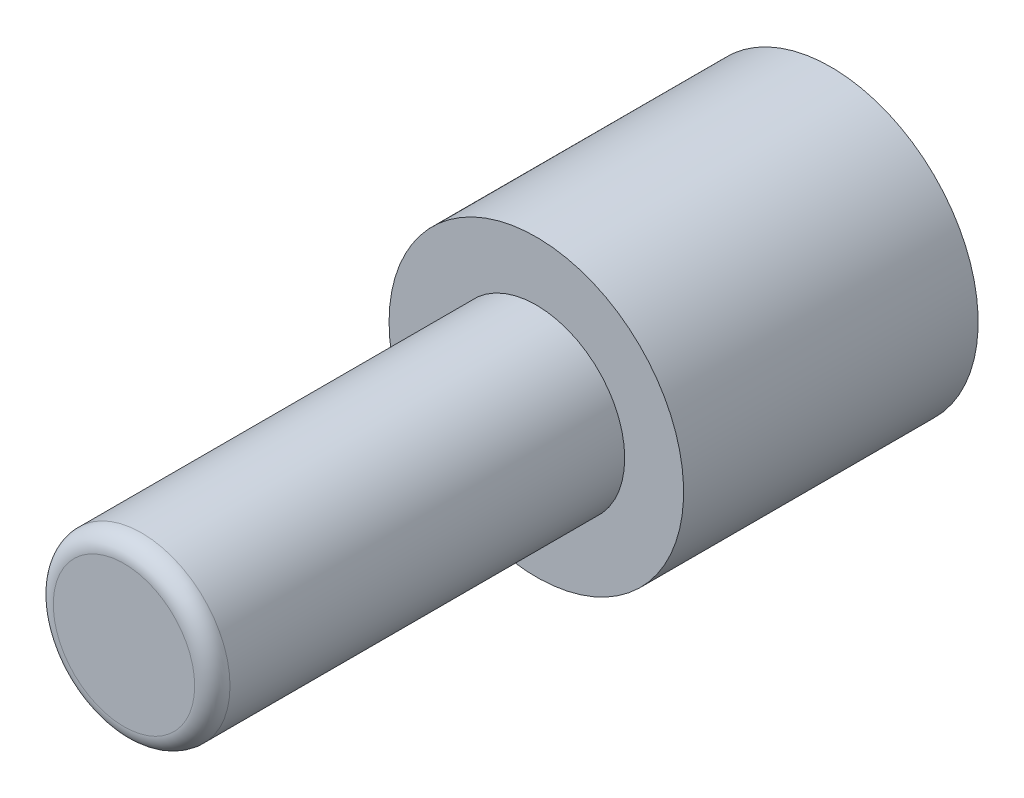
ISO-10303-21;
HEADER;
FILE_DESCRIPTION(('STEP AP214'),'2;1');
FILE_NAME('part.step','',(''),(''),'','','');
FILE_SCHEMA(('AUTOMOTIVE_DESIGN { 1 0 10303 214 1 1 1 1 }'));
ENDSEC;
DATA;
#1=APPLICATION_CONTEXT('core data for automotive mechanical design processes');
#2=APPLICATION_PROTOCOL_DEFINITION('international standard','automotive_design',2000,#1);
#3=PRODUCT_CONTEXT('',#1,'mechanical');
#4=PRODUCT('Part','Part','',(#3));
#5=PRODUCT_RELATED_PRODUCT_CATEGORY('part','',(#4));
#6=PRODUCT_DEFINITION_FORMATION('','',#4);
#7=PRODUCT_DEFINITION_CONTEXT('part definition',#1,'design');
#8=PRODUCT_DEFINITION('design','',#6,#7);
#9=PRODUCT_DEFINITION_SHAPE('','',#8);
#10=(LENGTH_UNIT() NAMED_UNIT(*) SI_UNIT(.MILLI.,.METRE.));
#11=(NAMED_UNIT(*) PLANE_ANGLE_UNIT() SI_UNIT($,.RADIAN.));
#12=(NAMED_UNIT(*) SI_UNIT($,.STERADIAN.) SOLID_ANGLE_UNIT());
#13=UNCERTAINTY_MEASURE_WITH_UNIT(LENGTH_MEASURE(1.E-05),#10,'distance_accuracy_value','');
#14=(GEOMETRIC_REPRESENTATION_CONTEXT(3) GLOBAL_UNCERTAINTY_ASSIGNED_CONTEXT((#13)) GLOBAL_UNIT_ASSIGNED_CONTEXT((#10,
#11,#12)) REPRESENTATION_CONTEXT('',''));
#15=CARTESIAN_POINT('',(0.,0.,0.));
#16=DIRECTION('',(0.,0.,1.));
#17=DIRECTION('',(1.,0.,0.));
#18=AXIS2_PLACEMENT_3D('',#15,#16,#17);
#19=CARTESIAN_POINT('',(0.,0.,7.));
#20=DIRECTION('',(0.,0.,-1.));
#21=DIRECTION('',(-1.,0.,0.));
#22=AXIS2_PLACEMENT_3D('',#19,#20,#21);
#23=CYLINDRICAL_SURFACE('',#22,1.5);
#24=CARTESIAN_POINT('',(0.,0.,6.7));
#25=DIRECTION('',(0.,0.,1.));
#26=DIRECTION('',(1.,0.,0.));
#27=AXIS2_PLACEMENT_3D('',#24,#25,#26);
#28=CIRCLE('',#27,1.5);
#29=CARTESIAN_POINT('',(1.5,0.,6.7));
#30=VERTEX_POINT('',#29);
#31=EDGE_CURVE('E10',#30,#30,#28,.F.);
#32=ORIENTED_EDGE('',*,*,#31,.T.);
#33=EDGE_LOOP('',(#32));
#34=FACE_BOUND('',#33,.T.);
#35=CARTESIAN_POINT('',(0.,0.,0.));
#36=DIRECTION('',(0.,0.,-1.));
#37=DIRECTION('',(-1.,0.,0.));
#38=AXIS2_PLACEMENT_3D('',#35,#36,#37);
#39=CIRCLE('',#38,1.5);
#40=CARTESIAN_POINT('',(-1.5,0.,0.));
#41=VERTEX_POINT('',#40);
#42=EDGE_CURVE('E41',#41,#41,#39,.T.);
#43=ORIENTED_EDGE('',*,*,#42,.F.);
#44=EDGE_LOOP('',(#43));
#45=FACE_BOUND('',#44,.T.);
#46=ADVANCED_FACE('F30',(#34,#45),#23,.T.);
#47=CARTESIAN_POINT('',(0.,0.,7.));
#48=DIRECTION('',(0.,0.,1.));
#49=DIRECTION('',(1.,0.,0.));
#50=AXIS2_PLACEMENT_3D('',#47,#48,#49);
#51=PLANE('',#50);
#52=CARTESIAN_POINT('',(0.,0.,7.));
#53=DIRECTION('',(0.,0.,1.));
#54=DIRECTION('',(1.,0.,0.));
#55=AXIS2_PLACEMENT_3D('',#52,#53,#54);
#56=CIRCLE('',#55,1.2);
#57=CARTESIAN_POINT('',(1.2,0.,7.));
#58=VERTEX_POINT('',#57);
#59=EDGE_CURVE('E37',#58,#58,#56,.T.);
#60=ORIENTED_EDGE('',*,*,#59,.T.);
#61=EDGE_LOOP('',(#60));
#62=FACE_BOUND('',#61,.T.);
#63=ADVANCED_FACE('F59',(#62),#51,.T.);
#64=CARTESIAN_POINT('',(0.,0.,-5.));
#65=DIRECTION('',(0.,0.,1.));
#66=DIRECTION('',(1.,0.,0.));
#67=AXIS2_PLACEMENT_3D('',#64,#65,#66);
#68=CYLINDRICAL_SURFACE('',#67,2.5);
#69=CARTESIAN_POINT('',(0.,0.,-5.));
#70=DIRECTION('',(0.,0.,-1.));
#71=DIRECTION('',(-1.,0.,0.));
#72=AXIS2_PLACEMENT_3D('',#69,#70,#71);
#73=CIRCLE('',#72,2.5);
#74=CARTESIAN_POINT('',(-2.5,0.,-5.));
#75=VERTEX_POINT('',#74);
#76=EDGE_CURVE('E45',#75,#75,#73,.T.);
#77=ORIENTED_EDGE('',*,*,#76,.F.);
#78=EDGE_LOOP('',(#77));
#79=FACE_BOUND('',#78,.T.);
#80=CARTESIAN_POINT('',(0.,0.,0.));
#81=DIRECTION('',(0.,0.,-1.));
#82=DIRECTION('',(-1.,0.,0.));
#83=AXIS2_PLACEMENT_3D('',#80,#81,#82);
#84=CIRCLE('',#83,2.5);
#85=CARTESIAN_POINT('',(-2.5,0.,0.));
#86=VERTEX_POINT('',#85);
#87=EDGE_CURVE('E48',#86,#86,#84,.T.);
#88=ORIENTED_EDGE('',*,*,#87,.T.);
#89=EDGE_LOOP('',(#88));
#90=FACE_BOUND('',#89,.T.);
#91=ADVANCED_FACE('F56',(#79,#90),#68,.T.);
#92=CARTESIAN_POINT('',(0.,0.,-5.));
#93=DIRECTION('',(0.,0.,-1.));
#94=DIRECTION('',(-1.,0.,0.));
#95=AXIS2_PLACEMENT_3D('',#92,#93,#94);
#96=PLANE('',#95);
#97=ORIENTED_EDGE('',*,*,#76,.T.);
#98=EDGE_LOOP('',(#97));
#99=FACE_BOUND('',#98,.T.);
#100=ADVANCED_FACE('F54',(#99),#96,.T.);
#101=CARTESIAN_POINT('',(0.,0.,0.));
#102=DIRECTION('',(0.,0.,-1.));
#103=DIRECTION('',(-1.,0.,0.));
#104=AXIS2_PLACEMENT_3D('',#101,#102,#103);
#105=PLANE('',#104);
#106=ORIENTED_EDGE('',*,*,#42,.T.);
#107=EDGE_LOOP('',(#106));
#108=FACE_BOUND('',#107,.T.);
#109=ORIENTED_EDGE('',*,*,#87,.F.);
#110=EDGE_LOOP('',(#109));
#111=FACE_BOUND('',#110,.T.);
#112=ADVANCED_FACE('F63',(#108,#111),#105,.F.);
#113=CARTESIAN_POINT('',(0.,0.,6.7));
#114=DIRECTION('',(0.,0.,1.));
#115=DIRECTION('',(1.,0.,0.));
#116=AXIS2_PLACEMENT_3D('',#113,#114,#115);
#117=TOROIDAL_SURFACE('',#116,1.2,0.3);
#118=ORIENTED_EDGE('',*,*,#31,.F.);
#119=EDGE_LOOP('',(#118));
#120=FACE_BOUND('',#119,.T.);
#121=ORIENTED_EDGE('',*,*,#59,.F.);
#122=EDGE_LOOP('',(#121));
#123=FACE_BOUND('',#122,.T.);
#124=ADVANCED_FACE('F32',(#120,#123),#117,.T.);
#125=CLOSED_SHELL('',(#46,#63,#91,#100,#112,#124));
#126=MANIFOLD_SOLID_BREP('B2',#125);
#127=ADVANCED_BREP_SHAPE_REPRESENTATION('',(#18,#126),#14);
#128=SHAPE_DEFINITION_REPRESENTATION(#9,#127);
ENDSEC;
END-ISO-10303-21;
